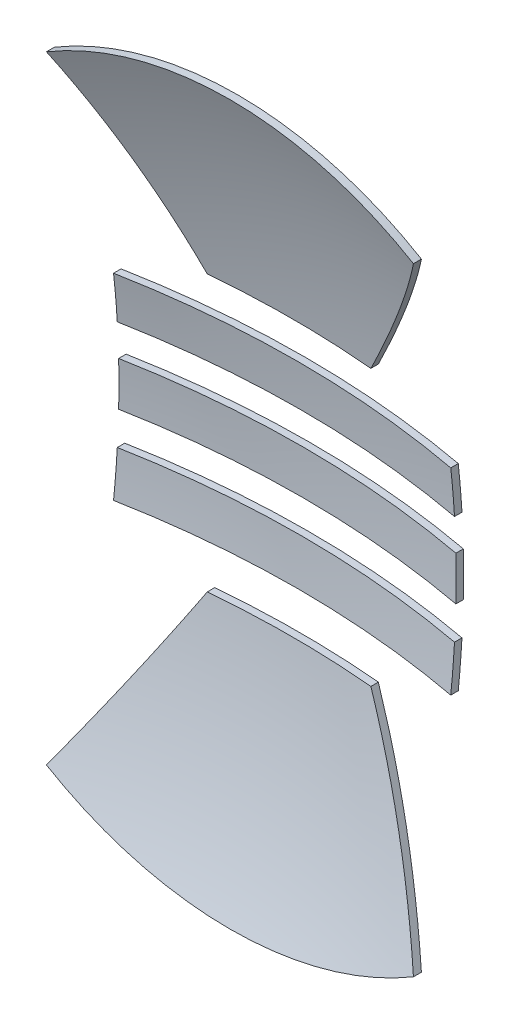
ISO-10303-21;
HEADER;
FILE_DESCRIPTION(('STEP AP214'),'2;1');
FILE_NAME('part.step','',(''),(''),'','','');
FILE_SCHEMA(('AUTOMOTIVE_DESIGN { 1 0 10303 214 1 1 1 1 }'));
ENDSEC;
DATA;
#1=APPLICATION_CONTEXT('core data for automotive mechanical design processes');
#2=APPLICATION_PROTOCOL_DEFINITION('international standard','automotive_design',2000,#1);
#3=PRODUCT_CONTEXT('',#1,'mechanical');
#4=PRODUCT('Part','Part','',(#3));
#5=PRODUCT_RELATED_PRODUCT_CATEGORY('part','',(#4));
#6=PRODUCT_DEFINITION_FORMATION('','',#4);
#7=PRODUCT_DEFINITION_CONTEXT('part definition',#1,'design');
#8=PRODUCT_DEFINITION('design','',#6,#7);
#9=PRODUCT_DEFINITION_SHAPE('','',#8);
#10=(LENGTH_UNIT() NAMED_UNIT(*) SI_UNIT(.MILLI.,.METRE.));
#11=(NAMED_UNIT(*) PLANE_ANGLE_UNIT() SI_UNIT($,.RADIAN.));
#12=(NAMED_UNIT(*) SI_UNIT($,.STERADIAN.) SOLID_ANGLE_UNIT());
#13=UNCERTAINTY_MEASURE_WITH_UNIT(LENGTH_MEASURE(1.E-05),#10,'distance_accuracy_value','');
#14=(GEOMETRIC_REPRESENTATION_CONTEXT(3) GLOBAL_UNCERTAINTY_ASSIGNED_CONTEXT((#13)) GLOBAL_UNIT_ASSIGNED_CONTEXT((#10,
#11,#12)) REPRESENTATION_CONTEXT('',''));
#15=CARTESIAN_POINT('',(0.,0.,0.));
#16=DIRECTION('',(0.,0.,1.));
#17=DIRECTION('',(1.,0.,0.));
#18=AXIS2_PLACEMENT_3D('',#15,#16,#17);
#19=CARTESIAN_POINT('',(0.,0.,0.));
#20=DIRECTION('',(0.,1.,0.));
#21=DIRECTION('',(-1.,0.,0.));
#22=AXIS2_PLACEMENT_3D('',#19,#20,#21);
#23=SPHERICAL_SURFACE('',#22,125.2);
#24=CARTESIAN_POINT('',(0.,-3.,0.));
#25=DIRECTION('',(0.,-1.,0.));
#26=DIRECTION('',(0.,0.,-1.));
#27=AXIS2_PLACEMENT_3D('',#24,#25,#26);
#28=CIRCLE('',#27,125.164052347309);
#29=CARTESIAN_POINT('',(23.,-3.,-123.032678585813));
#30=VERTEX_POINT('',#29);
#31=CARTESIAN_POINT('',(-22.9999999999992,-3.,-123.032678585813));
#32=VERTEX_POINT('',#31);
#33=EDGE_CURVE('E235',#30,#32,#28,.F.);
#34=ORIENTED_EDGE('',*,*,#33,.F.);
#35=CARTESIAN_POINT('',(22.9999999999996,2.93919980946332E-12,0.));
#36=DIRECTION('',(-1.,-1.27791296063625E-13,0.));
#37=DIRECTION('',(1.27791296063625E-13,-1.,0.));
#38=AXIS2_PLACEMENT_3D('',#35,#36,#37);
#39=CIRCLE('',#38,123.069248799203);
#40=CARTESIAN_POINT('',(22.9999999999992,3.,-123.032678585813));
#41=VERTEX_POINT('',#40);
#42=EDGE_CURVE('E186',#30,#41,#39,.F.);
#43=ORIENTED_EDGE('',*,*,#42,.T.);
#44=CARTESIAN_POINT('',(0.,3.,0.));
#45=DIRECTION('',(0.,-1.,0.));
#46=DIRECTION('',(0.,0.,-1.));
#47=AXIS2_PLACEMENT_3D('',#44,#45,#46);
#48=CIRCLE('',#47,125.164052347309);
#49=CARTESIAN_POINT('',(-22.9999999999992,3.,-123.032678585813));
#50=VERTEX_POINT('',#49);
#51=EDGE_CURVE('E206',#41,#50,#48,.F.);
#52=ORIENTED_EDGE('',*,*,#51,.T.);
#53=CARTESIAN_POINT('',(-22.9999999999992,0.,0.));
#54=DIRECTION('',(-1.,0.,0.));
#55=DIRECTION('',(0.,0.,1.));
#56=AXIS2_PLACEMENT_3D('',#53,#54,#55);
#57=CIRCLE('',#56,123.069248799203);
#58=EDGE_CURVE('E224',#32,#50,#57,.F.);
#59=ORIENTED_EDGE('',*,*,#58,.F.);
#60=EDGE_LOOP('',(#34,#43,#52,#59));
#61=FACE_BOUND('',#60,.T.);
#62=ADVANCED_FACE('F167',(#61),#23,.F.);
#63=CARTESIAN_POINT('',(0.,3.,-181.));
#64=DIRECTION('',(0.,-1.,0.));
#65=DIRECTION('',(0.,0.,-1.));
#66=AXIS2_PLACEMENT_3D('',#63,#64,#65);
#67=PLANE('',#66);
#68=CARTESIAN_POINT('',(0.,3.,0.));
#69=DIRECTION('',(0.,-1.,0.));
#70=DIRECTION('',(0.,0.,-1.));
#71=AXIS2_PLACEMENT_3D('',#68,#69,#70);
#72=CIRCLE('',#71,126.164337274842);
#73=CARTESIAN_POINT('',(22.9999999999992,3.,-124.050151148638));
#74=VERTEX_POINT('',#73);
#75=CARTESIAN_POINT('',(-22.9999999999992,3.,-124.050151148638));
#76=VERTEX_POINT('',#75);
#77=EDGE_CURVE('E212',#74,#76,#72,.F.);
#78=ORIENTED_EDGE('',*,*,#77,.T.);
#79=DIRECTION('',(0.,0.,1.));
#80=VECTOR('',#79,1.);
#81=CARTESIAN_POINT('',(-22.9999999999992,3.,-181.));
#82=LINE('',#81,#80);
#83=EDGE_CURVE('E209',#76,#50,#82,.T.);
#84=ORIENTED_EDGE('',*,*,#83,.T.);
#85=ORIENTED_EDGE('',*,*,#51,.F.);
#86=DIRECTION('',(0.,0.,1.));
#87=VECTOR('',#86,1.);
#88=CARTESIAN_POINT('',(22.9999999999992,3.,-181.));
#89=LINE('',#88,#87);
#90=EDGE_CURVE('E214',#74,#41,#89,.T.);
#91=ORIENTED_EDGE('',*,*,#90,.F.);
#92=EDGE_LOOP('',(#78,#84,#85,#91));
#93=FACE_BOUND('',#92,.T.);
#94=ADVANCED_FACE('F213',(#93),#67,.F.);
#95=CARTESIAN_POINT('',(-22.9999999999992,0.,-181.));
#96=DIRECTION('',(-1.,0.,0.));
#97=DIRECTION('',(0.,0.,1.));
#98=AXIS2_PLACEMENT_3D('',#95,#96,#97);
#99=PLANE('',#98);
#100=DIRECTION('',(0.,0.,1.));
#101=VECTOR('',#100,1.);
#102=CARTESIAN_POINT('',(-22.9999999999992,-3.,-181.));
#103=LINE('',#102,#101);
#104=CARTESIAN_POINT('',(-22.9999999999992,-3.,-124.050151148638));
#105=VERTEX_POINT('',#104);
#106=EDGE_CURVE('E225',#105,#32,#103,.T.);
#107=ORIENTED_EDGE('',*,*,#106,.T.);
#108=ORIENTED_EDGE('',*,*,#58,.T.);
#109=ORIENTED_EDGE('',*,*,#83,.F.);
#110=CARTESIAN_POINT('',(-22.9999999999992,0.,0.));
#111=DIRECTION('',(-1.,0.,0.));
#112=DIRECTION('',(0.,0.,1.));
#113=AXIS2_PLACEMENT_3D('',#110,#111,#112);
#114=CIRCLE('',#113,124.086421497278);
#115=EDGE_CURVE('E14',#105,#76,#114,.F.);
#116=ORIENTED_EDGE('',*,*,#115,.F.);
#117=EDGE_LOOP('',(#107,#108,#109,#116));
#118=FACE_BOUND('',#117,.T.);
#119=ADVANCED_FACE('F221',(#118),#99,.T.);
#120=CARTESIAN_POINT('',(0.,-3.,-181.));
#121=DIRECTION('',(0.,-1.,0.));
#122=DIRECTION('',(0.,0.,-1.));
#123=AXIS2_PLACEMENT_3D('',#120,#121,#122);
#124=PLANE('',#123);
#125=DIRECTION('',(0.,0.,1.));
#126=VECTOR('',#125,1.);
#127=CARTESIAN_POINT('',(23.,-3.,-181.));
#128=LINE('',#127,#126);
#129=CARTESIAN_POINT('',(23.,-3.,-124.050151148638));
#130=VERTEX_POINT('',#129);
#131=EDGE_CURVE('E171',#130,#30,#128,.T.);
#132=ORIENTED_EDGE('',*,*,#131,.T.);
#133=ORIENTED_EDGE('',*,*,#33,.T.);
#134=ORIENTED_EDGE('',*,*,#106,.F.);
#135=CARTESIAN_POINT('',(0.,-3.,0.));
#136=DIRECTION('',(0.,-1.,0.));
#137=DIRECTION('',(0.,0.,-1.));
#138=AXIS2_PLACEMENT_3D('',#135,#136,#137);
#139=CIRCLE('',#138,126.164337274842);
#140=EDGE_CURVE('E177',#130,#105,#139,.F.);
#141=ORIENTED_EDGE('',*,*,#140,.F.);
#142=EDGE_LOOP('',(#132,#133,#134,#141));
#143=FACE_BOUND('',#142,.T.);
#144=ADVANCED_FACE('F241',(#143),#124,.T.);
#145=CARTESIAN_POINT('',(22.9999999999996,2.93919980946332E-12,-181.));
#146=DIRECTION('',(-1.,-1.27791296063625E-13,0.));
#147=DIRECTION('',(1.27791296063625E-13,-1.,0.));
#148=AXIS2_PLACEMENT_3D('',#145,#146,#147);
#149=PLANE('',#148);
#150=CARTESIAN_POINT('',(22.9999999999996,2.93919980946332E-12,0.));
#151=DIRECTION('',(-1.,-1.27791296063625E-13,0.));
#152=DIRECTION('',(1.27791296063625E-13,-1.,0.));
#153=AXIS2_PLACEMENT_3D('',#150,#151,#152);
#154=CIRCLE('',#153,124.086421497278);
#155=EDGE_CURVE('E228',#130,#74,#154,.F.);
#156=ORIENTED_EDGE('',*,*,#155,.T.);
#157=ORIENTED_EDGE('',*,*,#90,.T.);
#158=ORIENTED_EDGE('',*,*,#42,.F.);
#159=ORIENTED_EDGE('',*,*,#131,.F.);
#160=EDGE_LOOP('',(#156,#157,#158,#159));
#161=FACE_BOUND('',#160,.T.);
#162=ADVANCED_FACE('F240',(#161),#149,.F.);
#163=CARTESIAN_POINT('',(0.,0.,0.));
#164=DIRECTION('',(0.,1.,0.));
#165=DIRECTION('',(-1.,0.,0.));
#166=AXIS2_PLACEMENT_3D('',#163,#164,#165);
#167=SPHERICAL_SURFACE('',#166,126.2);
#168=ORIENTED_EDGE('',*,*,#155,.F.);
#169=ORIENTED_EDGE('',*,*,#140,.T.);
#170=ORIENTED_EDGE('',*,*,#115,.T.);
#171=ORIENTED_EDGE('',*,*,#77,.F.);
#172=EDGE_LOOP('',(#168,#169,#170,#171));
#173=FACE_BOUND('',#172,.T.);
#174=ADVANCED_FACE('F169',(#173),#167,.T.);
#175=CLOSED_SHELL('',(#62,#94,#119,#144,#162,#174));
#176=MANIFOLD_SOLID_BREP('B2',#175);
#177=CARTESIAN_POINT('',(0.,0.,0.));
#178=DIRECTION('',(0.,1.,0.));
#179=DIRECTION('',(-1.,0.,0.));
#180=AXIS2_PLACEMENT_3D('',#177,#178,#179);
#181=SPHERICAL_SURFACE('',#180,125.2);
#182=CARTESIAN_POINT('',(0.,7.42170977125891,0.));
#183=DIRECTION('',(0.,-1.,0.));
#184=DIRECTION('',(1.,0.,0.));
#185=AXIS2_PLACEMENT_3D('',#182,#183,#184);
#186=CIRCLE('',#185,124.979831269174);
#187=CARTESIAN_POINT('',(22.9999999999992,7.42170977125892,-122.845261300838));
#188=VERTEX_POINT('',#187);
#189=CARTESIAN_POINT('',(-23.0000000000008,7.42170977125891,-122.845261300838));
#190=VERTEX_POINT('',#189);
#191=EDGE_CURVE('E375',#188,#190,#186,.F.);
#192=ORIENTED_EDGE('',*,*,#191,.F.);
#193=CARTESIAN_POINT('',(22.9999999999992,0.,0.));
#194=DIRECTION('',(-1.,0.,0.));
#195=DIRECTION('',(0.,0.,1.));
#196=AXIS2_PLACEMENT_3D('',#193,#194,#195);
#197=CIRCLE('',#196,123.069248799203);
#198=CARTESIAN_POINT('',(22.9999999999992,13.4217097712589,-122.335185890308));
#199=VERTEX_POINT('',#198);
#200=EDGE_CURVE('E326',#188,#199,#197,.F.);
#201=ORIENTED_EDGE('',*,*,#200,.T.);
#202=CARTESIAN_POINT('',(0.,13.4217097712589,0.));
#203=DIRECTION('',(0.,-1.,0.));
#204=DIRECTION('',(1.,0.,0.));
#205=AXIS2_PLACEMENT_3D('',#202,#203,#204);
#206=CIRCLE('',#205,124.478502990742);
#207=CARTESIAN_POINT('',(-23.0000000000008,13.4217097712589,-122.335185890307));
#208=VERTEX_POINT('',#207);
#209=EDGE_CURVE('E346',#199,#208,#206,.F.);
#210=ORIENTED_EDGE('',*,*,#209,.T.);
#211=CARTESIAN_POINT('',(-23.0000000000008,0.,0.));
#212=DIRECTION('',(-1.,0.,0.));
#213=DIRECTION('',(0.,0.,1.));
#214=AXIS2_PLACEMENT_3D('',#211,#212,#213);
#215=CIRCLE('',#214,123.069248799202);
#216=EDGE_CURVE('E364',#190,#208,#215,.F.);
#217=ORIENTED_EDGE('',*,*,#216,.F.);
#218=EDGE_LOOP('',(#192,#201,#210,#217));
#219=FACE_BOUND('',#218,.T.);
#220=ADVANCED_FACE('F307',(#219),#181,.F.);
#221=CARTESIAN_POINT('',(0.,13.4217097712589,-181.));
#222=DIRECTION('',(0.,-1.,0.));
#223=DIRECTION('',(1.,0.,0.));
#224=AXIS2_PLACEMENT_3D('',#221,#222,#223);
#225=PLANE('',#224);
#226=CARTESIAN_POINT('',(0.,13.4217097712589,0.));
#227=DIRECTION('',(0.,-1.,0.));
#228=DIRECTION('',(1.,0.,0.));
#229=AXIS2_PLACEMENT_3D('',#226,#227,#228);
#230=CIRCLE('',#229,125.484252824074);
#231=CARTESIAN_POINT('',(22.9999999999992,13.4217097712589,-123.358411577063));
#232=VERTEX_POINT('',#231);
#233=CARTESIAN_POINT('',(-23.0000000000008,13.4217097712589,-123.358411577063));
#234=VERTEX_POINT('',#233);
#235=EDGE_CURVE('E352',#232,#234,#230,.F.);
#236=ORIENTED_EDGE('',*,*,#235,.T.);
#237=DIRECTION('',(0.,0.,1.));
#238=VECTOR('',#237,1.);
#239=CARTESIAN_POINT('',(-23.0000000000008,13.4217097712589,-181.));
#240=LINE('',#239,#238);
#241=EDGE_CURVE('E349',#234,#208,#240,.T.);
#242=ORIENTED_EDGE('',*,*,#241,.T.);
#243=ORIENTED_EDGE('',*,*,#209,.F.);
#244=DIRECTION('',(0.,0.,1.));
#245=VECTOR('',#244,1.);
#246=CARTESIAN_POINT('',(22.9999999999992,13.4217097712589,-181.));
#247=LINE('',#246,#245);
#248=EDGE_CURVE('E354',#232,#199,#247,.T.);
#249=ORIENTED_EDGE('',*,*,#248,.F.);
#250=EDGE_LOOP('',(#236,#242,#243,#249));
#251=FACE_BOUND('',#250,.T.);
#252=ADVANCED_FACE('F353',(#251),#225,.F.);
#253=CARTESIAN_POINT('',(-23.0000000000008,0.,-181.));
#254=DIRECTION('',(-1.,0.,0.));
#255=DIRECTION('',(0.,0.,1.));
#256=AXIS2_PLACEMENT_3D('',#253,#254,#255);
#257=PLANE('',#256);
#258=DIRECTION('',(0.,0.,1.));
#259=VECTOR('',#258,1.);
#260=CARTESIAN_POINT('',(-23.0000000000008,7.42170977125891,-181.));
#261=LINE('',#260,#259);
#262=CARTESIAN_POINT('',(-23.0000000000008,7.42170977125891,-123.864273396614));
#263=VERTEX_POINT('',#262);
#264=EDGE_CURVE('E365',#263,#190,#261,.T.);
#265=ORIENTED_EDGE('',*,*,#264,.T.);
#266=ORIENTED_EDGE('',*,*,#216,.T.);
#267=ORIENTED_EDGE('',*,*,#241,.F.);
#268=CARTESIAN_POINT('',(-23.0000000000008,0.,0.));
#269=DIRECTION('',(-1.,0.,0.));
#270=DIRECTION('',(0.,0.,1.));
#271=AXIS2_PLACEMENT_3D('',#268,#269,#270);
#272=CIRCLE('',#271,124.086421497277);
#273=EDGE_CURVE('E165',#263,#234,#272,.F.);
#274=ORIENTED_EDGE('',*,*,#273,.F.);
#275=EDGE_LOOP('',(#265,#266,#267,#274));
#276=FACE_BOUND('',#275,.T.);
#277=ADVANCED_FACE('F361',(#276),#257,.T.);
#278=CARTESIAN_POINT('',(0.,7.42170977125891,-181.));
#279=DIRECTION('',(0.,-1.,0.));
#280=DIRECTION('',(1.,0.,0.));
#281=AXIS2_PLACEMENT_3D('',#278,#279,#280);
#282=PLANE('',#281);
#283=DIRECTION('',(0.,0.,1.));
#284=VECTOR('',#283,1.);
#285=CARTESIAN_POINT('',(22.9999999999992,7.42170977125892,-181.));
#286=LINE('',#285,#284);
#287=CARTESIAN_POINT('',(22.9999999999992,7.42170977125892,-123.864273396614));
#288=VERTEX_POINT('',#287);
#289=EDGE_CURVE('E311',#288,#188,#286,.T.);
#290=ORIENTED_EDGE('',*,*,#289,.T.);
#291=ORIENTED_EDGE('',*,*,#191,.T.);
#292=ORIENTED_EDGE('',*,*,#264,.F.);
#293=CARTESIAN_POINT('',(0.,7.42170977125891,0.));
#294=DIRECTION('',(0.,-1.,0.));
#295=DIRECTION('',(1.,0.,0.));
#296=AXIS2_PLACEMENT_3D('',#293,#294,#295);
#297=CIRCLE('',#296,125.981578907677);
#298=EDGE_CURVE('E317',#288,#263,#297,.F.);
#299=ORIENTED_EDGE('',*,*,#298,.F.);
#300=EDGE_LOOP('',(#290,#291,#292,#299));
#301=FACE_BOUND('',#300,.T.);
#302=ADVANCED_FACE('F381',(#301),#282,.T.);
#303=CARTESIAN_POINT('',(22.9999999999992,0.,-181.));
#304=DIRECTION('',(-1.,0.,0.));
#305=DIRECTION('',(0.,0.,1.));
#306=AXIS2_PLACEMENT_3D('',#303,#304,#305);
#307=PLANE('',#306);
#308=CARTESIAN_POINT('',(22.9999999999992,0.,0.));
#309=DIRECTION('',(-1.,0.,0.));
#310=DIRECTION('',(0.,0.,1.));
#311=AXIS2_PLACEMENT_3D('',#308,#309,#310);
#312=CIRCLE('',#311,124.086421497278);
#313=EDGE_CURVE('E368',#288,#232,#312,.F.);
#314=ORIENTED_EDGE('',*,*,#313,.T.);
#315=ORIENTED_EDGE('',*,*,#248,.T.);
#316=ORIENTED_EDGE('',*,*,#200,.F.);
#317=ORIENTED_EDGE('',*,*,#289,.F.);
#318=EDGE_LOOP('',(#314,#315,#316,#317));
#319=FACE_BOUND('',#318,.T.);
#320=ADVANCED_FACE('F380',(#319),#307,.F.);
#321=CARTESIAN_POINT('',(0.,0.,0.));
#322=DIRECTION('',(0.,1.,0.));
#323=DIRECTION('',(-1.,0.,0.));
#324=AXIS2_PLACEMENT_3D('',#321,#322,#323);
#325=SPHERICAL_SURFACE('',#324,126.2);
#326=ORIENTED_EDGE('',*,*,#313,.F.);
#327=ORIENTED_EDGE('',*,*,#298,.T.);
#328=ORIENTED_EDGE('',*,*,#273,.T.);
#329=ORIENTED_EDGE('',*,*,#235,.F.);
#330=EDGE_LOOP('',(#326,#327,#328,#329));
#331=FACE_BOUND('',#330,.T.);
#332=ADVANCED_FACE('F309',(#331),#325,.T.);
#333=CLOSED_SHELL('',(#220,#252,#277,#302,#320,#332));
#334=MANIFOLD_SOLID_BREP('B8',#333);
#335=CARTESIAN_POINT('',(0.,0.,0.));
#336=DIRECTION('',(0.,1.,0.));
#337=DIRECTION('',(-1.,0.,0.));
#338=AXIS2_PLACEMENT_3D('',#335,#336,#337);
#339=SPHERICAL_SURFACE('',#338,125.2);
#340=CARTESIAN_POINT('',(0.,-7.42170977125891,0.));
#341=DIRECTION('',(0.,-1.,0.));
#342=DIRECTION('',(1.,0.,0.));
#343=AXIS2_PLACEMENT_3D('',#340,#341,#342);
#344=CIRCLE('',#343,124.979831269174);
#345=CARTESIAN_POINT('',(22.9999999999992,-7.42170977125892,-122.845261300838));
#346=VERTEX_POINT('',#345);
#347=CARTESIAN_POINT('',(-23.0000000000008,-7.42170977125891,-122.845261300838));
#348=VERTEX_POINT('',#347);
#349=EDGE_CURVE('E514',#346,#348,#344,.F.);
#350=ORIENTED_EDGE('',*,*,#349,.T.);
#351=CARTESIAN_POINT('',(-23.0000000000008,0.,0.));
#352=DIRECTION('',(1.,0.,0.));
#353=DIRECTION('',(0.,0.,-1.));
#354=AXIS2_PLACEMENT_3D('',#351,#352,#353);
#355=CIRCLE('',#354,123.069248799202);
#356=CARTESIAN_POINT('',(-23.0000000000008,-13.4217097712589,-122.335185890307));
#357=VERTEX_POINT('',#356);
#358=EDGE_CURVE('E460',#348,#357,#355,.F.);
#359=ORIENTED_EDGE('',*,*,#358,.T.);
#360=CARTESIAN_POINT('',(0.,-13.4217097712589,0.));
#361=DIRECTION('',(0.,-1.,0.));
#362=DIRECTION('',(1.,0.,0.));
#363=AXIS2_PLACEMENT_3D('',#360,#361,#362);
#364=CIRCLE('',#363,124.478502990742);
#365=CARTESIAN_POINT('',(22.9999999999992,-13.4217097712589,-122.335185890308));
#366=VERTEX_POINT('',#365);
#367=EDGE_CURVE('E480',#366,#357,#364,.F.);
#368=ORIENTED_EDGE('',*,*,#367,.F.);
#369=CARTESIAN_POINT('',(22.9999999999992,0.,0.));
#370=DIRECTION('',(1.,0.,0.));
#371=DIRECTION('',(0.,0.,-1.));
#372=AXIS2_PLACEMENT_3D('',#369,#370,#371);
#373=CIRCLE('',#372,123.069248799203);
#374=EDGE_CURVE('E491',#346,#366,#373,.F.);
#375=ORIENTED_EDGE('',*,*,#374,.F.);
#376=EDGE_LOOP('',(#350,#359,#368,#375));
#377=FACE_BOUND('',#376,.T.);
#378=ADVANCED_FACE('F441',(#377),#339,.F.);
#379=CARTESIAN_POINT('',(0.,-13.4217097712589,-181.));
#380=DIRECTION('',(0.,-1.,0.));
#381=DIRECTION('',(1.,0.,0.));
#382=AXIS2_PLACEMENT_3D('',#379,#380,#381);
#383=PLANE('',#382);
#384=DIRECTION('',(0.,0.,1.));
#385=VECTOR('',#384,1.);
#386=CARTESIAN_POINT('',(22.9999999999992,-13.4217097712589,-181.));
#387=LINE('',#386,#385);
#388=CARTESIAN_POINT('',(22.9999999999992,-13.4217097712589,-123.358411577063));
#389=VERTEX_POINT('',#388);
#390=EDGE_CURVE('E483',#389,#366,#387,.T.);
#391=ORIENTED_EDGE('',*,*,#390,.T.);
#392=ORIENTED_EDGE('',*,*,#367,.T.);
#393=DIRECTION('',(0.,0.,1.));
#394=VECTOR('',#393,1.);
#395=CARTESIAN_POINT('',(-23.0000000000008,-13.4217097712589,-181.));
#396=LINE('',#395,#394);
#397=CARTESIAN_POINT('',(-23.0000000000008,-13.4217097712589,-123.358411577063));
#398=VERTEX_POINT('',#397);
#399=EDGE_CURVE('E505',#398,#357,#396,.T.);
#400=ORIENTED_EDGE('',*,*,#399,.F.);
#401=CARTESIAN_POINT('',(0.,-13.4217097712589,0.));
#402=DIRECTION('',(0.,-1.,0.));
#403=DIRECTION('',(1.,0.,0.));
#404=AXIS2_PLACEMENT_3D('',#401,#402,#403);
#405=CIRCLE('',#404,125.484252824074);
#406=EDGE_CURVE('E305',#389,#398,#405,.F.);
#407=ORIENTED_EDGE('',*,*,#406,.F.);
#408=EDGE_LOOP('',(#391,#392,#400,#407));
#409=FACE_BOUND('',#408,.T.);
#410=ADVANCED_FACE('F485',(#409),#383,.T.);
#411=CARTESIAN_POINT('',(22.9999999999992,0.,-181.));
#412=DIRECTION('',(1.,0.,0.));
#413=DIRECTION('',(0.,0.,-1.));
#414=AXIS2_PLACEMENT_3D('',#411,#412,#413);
#415=PLANE('',#414);
#416=DIRECTION('',(0.,0.,1.));
#417=VECTOR('',#416,1.);
#418=CARTESIAN_POINT('',(22.9999999999992,-7.42170977125892,-181.));
#419=LINE('',#418,#417);
#420=CARTESIAN_POINT('',(22.9999999999992,-7.42170977125892,-123.864273396614));
#421=VERTEX_POINT('',#420);
#422=EDGE_CURVE('E494',#421,#346,#419,.T.);
#423=ORIENTED_EDGE('',*,*,#422,.T.);
#424=ORIENTED_EDGE('',*,*,#374,.T.);
#425=ORIENTED_EDGE('',*,*,#390,.F.);
#426=CARTESIAN_POINT('',(22.9999999999992,0.,0.));
#427=DIRECTION('',(1.,0.,0.));
#428=DIRECTION('',(0.,0.,-1.));
#429=AXIS2_PLACEMENT_3D('',#426,#427,#428);
#430=CIRCLE('',#429,124.086421497278);
#431=EDGE_CURVE('E451',#421,#389,#430,.F.);
#432=ORIENTED_EDGE('',*,*,#431,.F.);
#433=EDGE_LOOP('',(#423,#424,#425,#432));
#434=FACE_BOUND('',#433,.T.);
#435=ADVANCED_FACE('F492',(#434),#415,.T.);
#436=CARTESIAN_POINT('',(0.,-7.42170977125891,-181.));
#437=DIRECTION('',(0.,-1.,0.));
#438=DIRECTION('',(1.,0.,0.));
#439=AXIS2_PLACEMENT_3D('',#436,#437,#438);
#440=PLANE('',#439);
#441=CARTESIAN_POINT('',(0.,-7.42170977125891,0.));
#442=DIRECTION('',(0.,-1.,0.));
#443=DIRECTION('',(1.,0.,0.));
#444=AXIS2_PLACEMENT_3D('',#441,#442,#443);
#445=CIRCLE('',#444,125.981578907677);
#446=CARTESIAN_POINT('',(-23.0000000000008,-7.42170977125891,-123.864273396614));
#447=VERTEX_POINT('',#446);
#448=EDGE_CURVE('E497',#421,#447,#445,.F.);
#449=ORIENTED_EDGE('',*,*,#448,.T.);
#450=DIRECTION('',(0.,0.,1.));
#451=VECTOR('',#450,1.);
#452=CARTESIAN_POINT('',(-23.0000000000008,-7.42170977125891,-181.));
#453=LINE('',#452,#451);
#454=EDGE_CURVE('E445',#447,#348,#453,.T.);
#455=ORIENTED_EDGE('',*,*,#454,.T.);
#456=ORIENTED_EDGE('',*,*,#349,.F.);
#457=ORIENTED_EDGE('',*,*,#422,.F.);
#458=EDGE_LOOP('',(#449,#455,#456,#457));
#459=FACE_BOUND('',#458,.T.);
#460=ADVANCED_FACE('F513',(#459),#440,.F.);
#461=CARTESIAN_POINT('',(-23.0000000000008,0.,-181.));
#462=DIRECTION('',(1.,0.,0.));
#463=DIRECTION('',(0.,0.,-1.));
#464=AXIS2_PLACEMENT_3D('',#461,#462,#463);
#465=PLANE('',#464);
#466=CARTESIAN_POINT('',(-23.0000000000008,0.,0.));
#467=DIRECTION('',(1.,0.,0.));
#468=DIRECTION('',(0.,0.,-1.));
#469=AXIS2_PLACEMENT_3D('',#466,#467,#468);
#470=CIRCLE('',#469,124.086421497277);
#471=EDGE_CURVE('E502',#447,#398,#470,.F.);
#472=ORIENTED_EDGE('',*,*,#471,.T.);
#473=ORIENTED_EDGE('',*,*,#399,.T.);
#474=ORIENTED_EDGE('',*,*,#358,.F.);
#475=ORIENTED_EDGE('',*,*,#454,.F.);
#476=EDGE_LOOP('',(#472,#473,#474,#475));
#477=FACE_BOUND('',#476,.T.);
#478=ADVANCED_FACE('F508',(#477),#465,.F.);
#479=CARTESIAN_POINT('',(0.,0.,0.));
#480=DIRECTION('',(0.,1.,0.));
#481=DIRECTION('',(-1.,0.,0.));
#482=AXIS2_PLACEMENT_3D('',#479,#480,#481);
#483=SPHERICAL_SURFACE('',#482,126.2);
#484=ORIENTED_EDGE('',*,*,#471,.F.);
#485=ORIENTED_EDGE('',*,*,#448,.F.);
#486=ORIENTED_EDGE('',*,*,#431,.T.);
#487=ORIENTED_EDGE('',*,*,#406,.T.);
#488=EDGE_LOOP('',(#484,#485,#486,#487));
#489=FACE_BOUND('',#488,.T.);
#490=ADVANCED_FACE('F443',(#489),#483,.T.);
#491=CLOSED_SHELL('',(#378,#410,#435,#460,#478,#490));
#492=MANIFOLD_SOLID_BREP('B159',#491);
#493=CARTESIAN_POINT('',(0.,0.,0.));
#494=DIRECTION('',(0.,1.,0.));
#495=DIRECTION('',(-1.,0.,0.));
#496=AXIS2_PLACEMENT_3D('',#493,#494,#495);
#497=SPHERICAL_SURFACE('',#496,125.2);
#498=CARTESIAN_POINT('',(0.,0.,0.));
#499=DIRECTION('',(-0.859672123040661,0.510846200795075,0.));
#500=DIRECTION('',(-0.510846200795075,-0.859672123040661,0.));
#501=AXIS2_PLACEMENT_3D('',#498,#499,#500);
#502=CIRCLE('',#501,125.2);
#503=CARTESIAN_POINT('',(-25.0314638389587,-42.1239340289924,-115.213020097557));
#504=VERTEX_POINT('',#503);
#505=CARTESIAN_POINT('',(-11.1617909939808,-18.7835018559349,-123.278686235029));
#506=VERTEX_POINT('',#505);
#507=EDGE_CURVE('E639',#504,#506,#502,.F.);
#508=ORIENTED_EDGE('',*,*,#507,.F.);
#509=CARTESIAN_POINT('',(0.,0.,-115.213020097557));
#510=DIRECTION('',(0.,0.,1.));
#511=DIRECTION('',(1.,0.,0.));
#512=AXIS2_PLACEMENT_3D('',#509,#510,#511);
#513=CIRCLE('',#512,49.);
#514=CARTESIAN_POINT('',(25.0314638389575,-42.1239340289931,-115.213020097557));
#515=VERTEX_POINT('',#514);
#516=EDGE_CURVE('E593',#504,#515,#513,.T.);
#517=ORIENTED_EDGE('',*,*,#516,.T.);
#518=CARTESIAN_POINT('',(0.,0.,0.));
#519=DIRECTION('',(-0.859672123040676,-0.510846200795051,0.));
#520=DIRECTION('',(0.510846200795051,-0.859672123040676,0.));
#521=AXIS2_PLACEMENT_3D('',#518,#519,#520);
#522=CIRCLE('',#521,125.2);
#523=CARTESIAN_POINT('',(11.1617909939801,-18.7835018559349,-123.278686235029));
#524=VERTEX_POINT('',#523);
#525=EDGE_CURVE('E613',#515,#524,#522,.F.);
#526=ORIENTED_EDGE('',*,*,#525,.T.);
#527=CARTESIAN_POINT('',(0.,-18.7835018559349,0.));
#528=DIRECTION('',(0.,-1.,0.));
#529=DIRECTION('',(1.,0.,0.));
#530=AXIS2_PLACEMENT_3D('',#527,#528,#529);
#531=CIRCLE('',#530,123.782955442291);
#532=EDGE_CURVE('E625',#524,#506,#531,.F.);
#533=ORIENTED_EDGE('',*,*,#532,.T.);
#534=EDGE_LOOP('',(#508,#517,#526,#533));
#535=FACE_BOUND('',#534,.T.);
#536=ADVANCED_FACE('F574',(#535),#497,.F.);
#537=CARTESIAN_POINT('',(0.,0.,-181.));
#538=DIRECTION('',(-0.859672123040676,-0.510846200795051,0.));
#539=DIRECTION('',(0.510846200795051,-0.859672123040676,0.));
#540=AXIS2_PLACEMENT_3D('',#537,#538,#539);
#541=PLANE('',#540);
#542=CARTESIAN_POINT('',(0.,0.,0.));
#543=DIRECTION('',(-0.859672123040676,-0.510846200795051,0.));
#544=DIRECTION('',(0.510846200795051,-0.859672123040676,0.));
#545=AXIS2_PLACEMENT_3D('',#542,#543,#544);
#546=CIRCLE('',#545,126.2);
#547=CARTESIAN_POINT('',(25.0314638389575,-42.1239340289931,-116.298925188499));
#548=VERTEX_POINT('',#547);
#549=CARTESIAN_POINT('',(11.1617909939801,-18.7835018559349,-124.294144994182));
#550=VERTEX_POINT('',#549);
#551=EDGE_CURVE('E619',#548,#550,#546,.F.);
#552=ORIENTED_EDGE('',*,*,#551,.T.);
#553=DIRECTION('',(0.,0.,1.));
#554=VECTOR('',#553,1.);
#555=CARTESIAN_POINT('',(11.1617909939801,-18.7835018559349,-181.));
#556=LINE('',#555,#554);
#557=EDGE_CURVE('E616',#550,#524,#556,.T.);
#558=ORIENTED_EDGE('',*,*,#557,.T.);
#559=ORIENTED_EDGE('',*,*,#525,.F.);
#560=DIRECTION('',(0.,0.,1.));
#561=VECTOR('',#560,1.);
#562=CARTESIAN_POINT('',(25.0314638389575,-42.1239340289931,-181.));
#563=LINE('',#562,#561);
#564=EDGE_CURVE('E584',#548,#515,#563,.T.);
#565=ORIENTED_EDGE('',*,*,#564,.F.);
#566=EDGE_LOOP('',(#552,#558,#559,#565));
#567=FACE_BOUND('',#566,.T.);
#568=ADVANCED_FACE('F620',(#567),#541,.F.);
#569=CARTESIAN_POINT('',(0.,-18.7835018559349,-181.));
#570=DIRECTION('',(0.,-1.,0.));
#571=DIRECTION('',(1.,0.,0.));
#572=AXIS2_PLACEMENT_3D('',#569,#570,#571);
#573=PLANE('',#572);
#574=CARTESIAN_POINT('',(0.,-18.7835018559349,0.));
#575=DIRECTION('',(0.,-1.,0.));
#576=DIRECTION('',(1.,0.,0.));
#577=AXIS2_PLACEMENT_3D('',#574,#575,#576);
#578=CIRCLE('',#577,124.794311000254);
#579=CARTESIAN_POINT('',(-11.1617909939808,-18.7835018559349,-124.294144994182));
#580=VERTEX_POINT('',#579);
#581=EDGE_CURVE('E630',#550,#580,#578,.F.);
#582=ORIENTED_EDGE('',*,*,#581,.T.);
#583=DIRECTION('',(0.,0.,1.));
#584=VECTOR('',#583,1.);
#585=CARTESIAN_POINT('',(-11.1617909939808,-18.7835018559349,-181.));
#586=LINE('',#585,#584);
#587=EDGE_CURVE('E634',#580,#506,#586,.T.);
#588=ORIENTED_EDGE('',*,*,#587,.T.);
#589=ORIENTED_EDGE('',*,*,#532,.F.);
#590=ORIENTED_EDGE('',*,*,#557,.F.);
#591=EDGE_LOOP('',(#582,#588,#589,#590));
#592=FACE_BOUND('',#591,.T.);
#593=ADVANCED_FACE('F628',(#592),#573,.F.);
#594=CARTESIAN_POINT('',(0.,0.,-181.));
#595=DIRECTION('',(-0.859672123040661,0.510846200795075,0.));
#596=DIRECTION('',(-0.510846200795075,-0.859672123040661,0.));
#597=AXIS2_PLACEMENT_3D('',#594,#595,#596);
#598=PLANE('',#597);
#599=DIRECTION('',(0.,0.,1.));
#600=VECTOR('',#599,1.);
#601=CARTESIAN_POINT('',(-25.0314638389587,-42.1239340289924,-181.));
#602=LINE('',#601,#600);
#603=CARTESIAN_POINT('',(-25.0314638389587,-42.1239340289924,-116.298925188499));
#604=VERTEX_POINT('',#603);
#605=EDGE_CURVE('E578',#604,#504,#602,.T.);
#606=ORIENTED_EDGE('',*,*,#605,.T.);
#607=ORIENTED_EDGE('',*,*,#507,.T.);
#608=ORIENTED_EDGE('',*,*,#587,.F.);
#609=CARTESIAN_POINT('',(0.,0.,0.));
#610=DIRECTION('',(-0.859672123040661,0.510846200795075,0.));
#611=DIRECTION('',(-0.510846200795075,-0.859672123040661,0.));
#612=AXIS2_PLACEMENT_3D('',#609,#610,#611);
#613=CIRCLE('',#612,126.2);
#614=EDGE_CURVE('E439',#604,#580,#613,.F.);
#615=ORIENTED_EDGE('',*,*,#614,.F.);
#616=EDGE_LOOP('',(#606,#607,#608,#615));
#617=FACE_BOUND('',#616,.T.);
#618=ADVANCED_FACE('F647',(#617),#598,.T.);
#619=CARTESIAN_POINT('',(0.,0.,-181.));
#620=DIRECTION('',(0.,0.,1.));
#621=DIRECTION('',(1.,0.,0.));
#622=AXIS2_PLACEMENT_3D('',#619,#620,#621);
#623=CYLINDRICAL_SURFACE('',#622,49.);
#624=CARTESIAN_POINT('',(0.,0.,-116.298925188499));
#625=DIRECTION('',(0.,0.,1.));
#626=DIRECTION('',(1.,0.,0.));
#627=AXIS2_PLACEMENT_3D('',#624,#625,#626);
#628=CIRCLE('',#627,49.);
#629=EDGE_CURVE('E638',#604,#548,#628,.T.);
#630=ORIENTED_EDGE('',*,*,#629,.T.);
#631=ORIENTED_EDGE('',*,*,#564,.T.);
#632=ORIENTED_EDGE('',*,*,#516,.F.);
#633=ORIENTED_EDGE('',*,*,#605,.F.);
#634=EDGE_LOOP('',(#630,#631,#632,#633));
#635=FACE_BOUND('',#634,.T.);
#636=ADVANCED_FACE('F648',(#635),#623,.T.);
#637=CARTESIAN_POINT('',(0.,0.,0.));
#638=DIRECTION('',(0.,1.,0.));
#639=DIRECTION('',(-1.,0.,0.));
#640=AXIS2_PLACEMENT_3D('',#637,#638,#639);
#641=SPHERICAL_SURFACE('',#640,126.2);
#642=ORIENTED_EDGE('',*,*,#629,.F.);
#643=ORIENTED_EDGE('',*,*,#614,.T.);
#644=ORIENTED_EDGE('',*,*,#581,.F.);
#645=ORIENTED_EDGE('',*,*,#551,.F.);
#646=EDGE_LOOP('',(#642,#643,#644,#645));
#647=FACE_BOUND('',#646,.T.);
#648=ADVANCED_FACE('F576',(#647),#641,.T.);
#649=CLOSED_SHELL('',(#536,#568,#593,#618,#636,#648));
#650=MANIFOLD_SOLID_BREP('B299',#649);
#651=CARTESIAN_POINT('',(0.,0.,0.));
#652=DIRECTION('',(0.,1.,0.));
#653=DIRECTION('',(-1.,0.,0.));
#654=AXIS2_PLACEMENT_3D('',#651,#652,#653);
#655=SPHERICAL_SURFACE('',#654,125.2);
#656=CARTESIAN_POINT('',(0.,0.,0.));
#657=DIRECTION('',(0.859672123040676,-0.510846200795051,0.));
#658=DIRECTION('',(0.510846200795051,0.859672123040676,0.));
#659=AXIS2_PLACEMENT_3D('',#656,#657,#658);
#660=CIRCLE('',#659,125.2);
#661=CARTESIAN_POINT('',(25.0314638389575,42.1239340289931,-115.213020097557));
#662=VERTEX_POINT('',#661);
#663=CARTESIAN_POINT('',(11.1617909939801,18.7835018559349,-123.278686235029));
#664=VERTEX_POINT('',#663);
#665=EDGE_CURVE('E572',#662,#664,#660,.F.);
#666=ORIENTED_EDGE('',*,*,#665,.F.);
#667=CARTESIAN_POINT('',(0.,0.,-115.213020097557));
#668=DIRECTION('',(0.,0.,1.));
#669=DIRECTION('',(1.,0.,0.));
#670=AXIS2_PLACEMENT_3D('',#667,#668,#669);
#671=CIRCLE('',#670,49.);
#672=CARTESIAN_POINT('',(-25.0314638389587,42.1239340289924,-115.213020097557));
#673=VERTEX_POINT('',#672);
#674=EDGE_CURVE('E760',#673,#662,#671,.F.);
#675=ORIENTED_EDGE('',*,*,#674,.F.);
#676=CARTESIAN_POINT('',(0.,0.,0.));
#677=DIRECTION('',(0.859672123040661,0.510846200795075,0.));
#678=DIRECTION('',(-0.510846200795075,0.859672123040661,0.));
#679=AXIS2_PLACEMENT_3D('',#676,#677,#678);
#680=CIRCLE('',#679,125.2);
#681=CARTESIAN_POINT('',(-11.1617909939808,18.7835018559349,-123.278686235029));
#682=VERTEX_POINT('',#681);
#683=EDGE_CURVE('E748',#673,#682,#680,.F.);
#684=ORIENTED_EDGE('',*,*,#683,.T.);
#685=CARTESIAN_POINT('',(0.,18.7835018559349,0.));
#686=DIRECTION('',(0.,-1.,0.));
#687=DIRECTION('',(1.,0.,0.));
#688=AXIS2_PLACEMENT_3D('',#685,#686,#687);
#689=CIRCLE('',#688,123.782955442291);
#690=EDGE_CURVE('E706',#664,#682,#689,.F.);
#691=ORIENTED_EDGE('',*,*,#690,.F.);
#692=EDGE_LOOP('',(#666,#675,#684,#691));
#693=FACE_BOUND('',#692,.T.);
#694=ADVANCED_FACE('F698',(#693),#655,.F.);
#695=CARTESIAN_POINT('',(0.,0.,-181.));
#696=DIRECTION('',(0.859672123040676,-0.510846200795051,0.));
#697=DIRECTION('',(0.510846200795051,0.859672123040676,0.));
#698=AXIS2_PLACEMENT_3D('',#695,#696,#697);
#699=PLANE('',#698);
#700=DIRECTION('',(0.,0.,1.));
#701=VECTOR('',#700,1.);
#702=CARTESIAN_POINT('',(25.0314638389575,42.1239340289931,-181.));
#703=LINE('',#702,#701);
#704=CARTESIAN_POINT('',(25.0314638389575,42.1239340289931,-116.298925188499));
#705=VERTEX_POINT('',#704);
#706=EDGE_CURVE('E713',#705,#662,#703,.T.);
#707=ORIENTED_EDGE('',*,*,#706,.T.);
#708=ORIENTED_EDGE('',*,*,#665,.T.);
#709=DIRECTION('',(0.,0.,1.));
#710=VECTOR('',#709,1.);
#711=CARTESIAN_POINT('',(11.1617909939801,18.7835018559349,-181.));
#712=LINE('',#711,#710);
#713=CARTESIAN_POINT('',(11.1617909939801,18.7835018559349,-124.294144994182));
#714=VERTEX_POINT('',#713);
#715=EDGE_CURVE('E741',#714,#664,#712,.T.);
#716=ORIENTED_EDGE('',*,*,#715,.F.);
#717=CARTESIAN_POINT('',(0.,0.,0.));
#718=DIRECTION('',(0.859672123040676,-0.510846200795051,0.));
#719=DIRECTION('',(0.510846200795051,0.859672123040676,0.));
#720=AXIS2_PLACEMENT_3D('',#717,#718,#719);
#721=CIRCLE('',#720,126.2);
#722=EDGE_CURVE('E755',#705,#714,#721,.F.);
#723=ORIENTED_EDGE('',*,*,#722,.F.);
#724=EDGE_LOOP('',(#707,#708,#716,#723));
#725=FACE_BOUND('',#724,.T.);
#726=ADVANCED_FACE('F771',(#725),#699,.T.);
#727=CARTESIAN_POINT('',(0.,18.7835018559349,-181.));
#728=DIRECTION('',(0.,-1.,0.));
#729=DIRECTION('',(1.,0.,0.));
#730=AXIS2_PLACEMENT_3D('',#727,#728,#729);
#731=PLANE('',#730);
#732=ORIENTED_EDGE('',*,*,#715,.T.);
#733=ORIENTED_EDGE('',*,*,#690,.T.);
#734=DIRECTION('',(0.,0.,1.));
#735=VECTOR('',#734,1.);
#736=CARTESIAN_POINT('',(-11.1617909939808,18.7835018559349,-181.));
#737=LINE('',#736,#735);
#738=CARTESIAN_POINT('',(-11.1617909939808,18.7835018559349,-124.294144994182));
#739=VERTEX_POINT('',#738);
#740=EDGE_CURVE('E750',#739,#682,#737,.T.);
#741=ORIENTED_EDGE('',*,*,#740,.F.);
#742=CARTESIAN_POINT('',(0.,18.7835018559349,0.));
#743=DIRECTION('',(0.,-1.,0.));
#744=DIRECTION('',(1.,0.,0.));
#745=AXIS2_PLACEMENT_3D('',#742,#743,#744);
#746=CIRCLE('',#745,124.794311000254);
#747=EDGE_CURVE('E753',#714,#739,#746,.F.);
#748=ORIENTED_EDGE('',*,*,#747,.F.);
#749=EDGE_LOOP('',(#732,#733,#741,#748));
#750=FACE_BOUND('',#749,.T.);
#751=ADVANCED_FACE('F765',(#750),#731,.T.);
#752=CARTESIAN_POINT('',(0.,0.,-181.));
#753=DIRECTION('',(0.859672123040661,0.510846200795075,0.));
#754=DIRECTION('',(-0.510846200795075,0.859672123040661,0.));
#755=AXIS2_PLACEMENT_3D('',#752,#753,#754);
#756=PLANE('',#755);
#757=CARTESIAN_POINT('',(0.,0.,0.));
#758=DIRECTION('',(0.859672123040661,0.510846200795075,0.));
#759=DIRECTION('',(-0.510846200795075,0.859672123040661,0.));
#760=AXIS2_PLACEMENT_3D('',#757,#758,#759);
#761=CIRCLE('',#760,126.2);
#762=CARTESIAN_POINT('',(-25.0314638389587,42.1239340289924,-116.298925188499));
#763=VERTEX_POINT('',#762);
#764=EDGE_CURVE('E740',#763,#739,#761,.F.);
#765=ORIENTED_EDGE('',*,*,#764,.T.);
#766=ORIENTED_EDGE('',*,*,#740,.T.);
#767=ORIENTED_EDGE('',*,*,#683,.F.);
#768=DIRECTION('',(0.,0.,1.));
#769=VECTOR('',#768,1.);
#770=CARTESIAN_POINT('',(-25.0314638389587,42.1239340289924,-181.));
#771=LINE('',#770,#769);
#772=EDGE_CURVE('E718',#763,#673,#771,.T.);
#773=ORIENTED_EDGE('',*,*,#772,.F.);
#774=EDGE_LOOP('',(#765,#766,#767,#773));
#775=FACE_BOUND('',#774,.T.);
#776=ADVANCED_FACE('F744',(#775),#756,.F.);
#777=CARTESIAN_POINT('',(0.,0.,-181.));
#778=DIRECTION('',(0.,0.,1.));
#779=DIRECTION('',(1.,0.,0.));
#780=AXIS2_PLACEMENT_3D('',#777,#778,#779);
#781=CYLINDRICAL_SURFACE('',#780,49.);
#782=ORIENTED_EDGE('',*,*,#772,.T.);
#783=ORIENTED_EDGE('',*,*,#674,.T.);
#784=ORIENTED_EDGE('',*,*,#706,.F.);
#785=CARTESIAN_POINT('',(0.,0.,-116.298925188499));
#786=DIRECTION('',(0.,0.,1.));
#787=DIRECTION('',(1.,0.,0.));
#788=AXIS2_PLACEMENT_3D('',#785,#786,#787);
#789=CIRCLE('',#788,49.);
#790=EDGE_CURVE('E735',#763,#705,#789,.F.);
#791=ORIENTED_EDGE('',*,*,#790,.F.);
#792=EDGE_LOOP('',(#782,#783,#784,#791));
#793=FACE_BOUND('',#792,.T.);
#794=ADVANCED_FACE('F736',(#793),#781,.T.);
#795=CARTESIAN_POINT('',(0.,0.,0.));
#796=DIRECTION('',(0.,1.,0.));
#797=DIRECTION('',(-1.,0.,0.));
#798=AXIS2_PLACEMENT_3D('',#795,#796,#797);
#799=SPHERICAL_SURFACE('',#798,126.2);
#800=ORIENTED_EDGE('',*,*,#790,.T.);
#801=ORIENTED_EDGE('',*,*,#722,.T.);
#802=ORIENTED_EDGE('',*,*,#747,.T.);
#803=ORIENTED_EDGE('',*,*,#764,.F.);
#804=EDGE_LOOP('',(#800,#801,#802,#803));
#805=FACE_BOUND('',#804,.T.);
#806=ADVANCED_FACE('F700',(#805),#799,.T.);
#807=CLOSED_SHELL('',(#694,#726,#751,#776,#794,#806));
#808=MANIFOLD_SOLID_BREP('B433',#807);
#809=ADVANCED_BREP_SHAPE_REPRESENTATION('',(#18,#176,#334,#492,#650,#808),#14);
#810=SHAPE_DEFINITION_REPRESENTATION(#9,#809);
ENDSEC;
END-ISO-10303-21;
